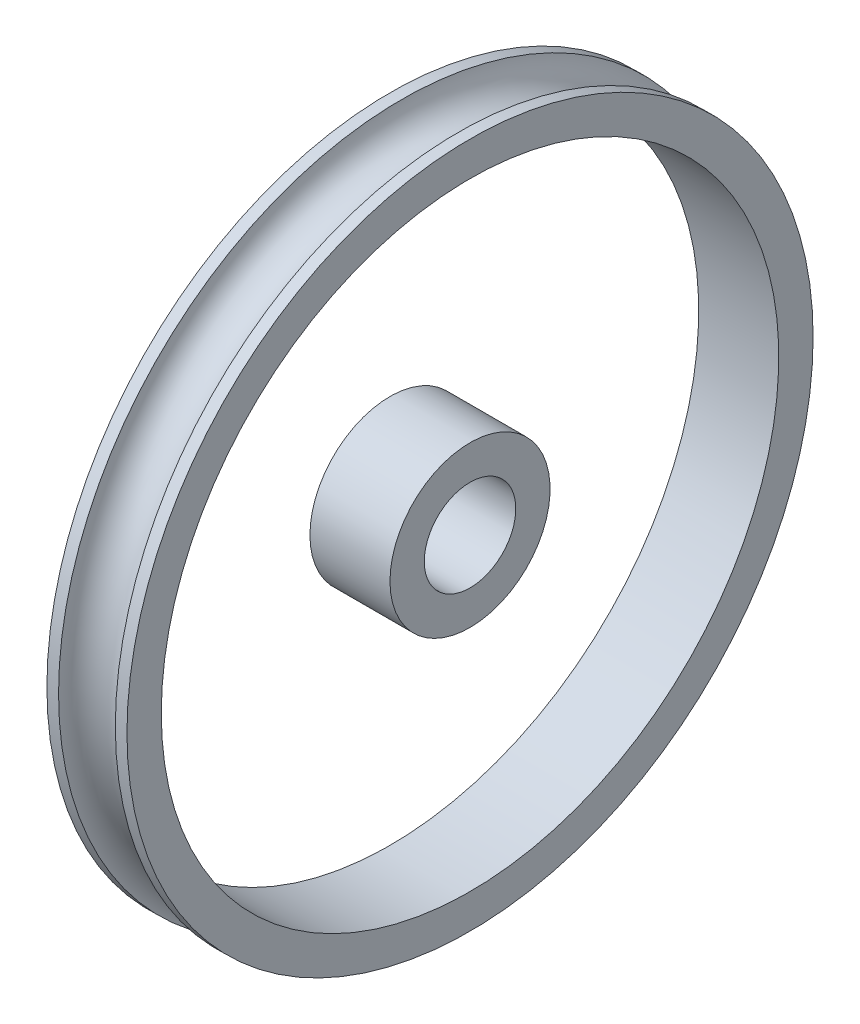
ISO-10303-21;
HEADER;
FILE_DESCRIPTION(('STEP AP214'),'2;1');
FILE_NAME('part.step','',(''),(''),'','','');
FILE_SCHEMA(('AUTOMOTIVE_DESIGN { 1 0 10303 214 1 1 1 1 }'));
ENDSEC;
DATA;
#1=APPLICATION_CONTEXT('core data for automotive mechanical design processes');
#2=APPLICATION_PROTOCOL_DEFINITION('international standard','automotive_design',2000,#1);
#3=PRODUCT_CONTEXT('',#1,'mechanical');
#4=PRODUCT('Part','Part','',(#3));
#5=PRODUCT_RELATED_PRODUCT_CATEGORY('part','',(#4));
#6=PRODUCT_DEFINITION_FORMATION('','',#4);
#7=PRODUCT_DEFINITION_CONTEXT('part definition',#1,'design');
#8=PRODUCT_DEFINITION('design','',#6,#7);
#9=PRODUCT_DEFINITION_SHAPE('','',#8);
#10=(LENGTH_UNIT() NAMED_UNIT(*) SI_UNIT(.MILLI.,.METRE.));
#11=(NAMED_UNIT(*) PLANE_ANGLE_UNIT() SI_UNIT($,.RADIAN.));
#12=(NAMED_UNIT(*) SI_UNIT($,.STERADIAN.) SOLID_ANGLE_UNIT());
#13=UNCERTAINTY_MEASURE_WITH_UNIT(LENGTH_MEASURE(1.E-05),#10,'distance_accuracy_value','');
#14=(GEOMETRIC_REPRESENTATION_CONTEXT(3) GLOBAL_UNCERTAINTY_ASSIGNED_CONTEXT((#13)) GLOBAL_UNIT_ASSIGNED_CONTEXT((#10,
#11,#12)) REPRESENTATION_CONTEXT('',''));
#15=CARTESIAN_POINT('',(0.,0.,0.));
#16=DIRECTION('',(0.,0.,1.));
#17=DIRECTION('',(1.,0.,0.));
#18=AXIS2_PLACEMENT_3D('',#15,#16,#17);
#19=CARTESIAN_POINT('',(0.,0.,-4.));
#20=DIRECTION('',(1.,0.,0.));
#21=DIRECTION('',(0.,0.,-1.));
#22=AXIS2_PLACEMENT_3D('',#19,#20,#21);
#23=PLANE('',#22);
#24=CARTESIAN_POINT('',(0.,0.,0.));
#25=DIRECTION('',(-1.,0.,0.));
#26=DIRECTION('',(0.,0.,1.));
#27=AXIS2_PLACEMENT_3D('',#24,#25,#26);
#28=CIRCLE('',#27,4.);
#29=CARTESIAN_POINT('',(0.,0.,4.));
#30=VERTEX_POINT('',#29);
#31=EDGE_CURVE('E63',#30,#30,#28,.T.);
#32=ORIENTED_EDGE('',*,*,#31,.F.);
#33=EDGE_LOOP('',(#32));
#34=FACE_BOUND('',#33,.T.);
#35=CARTESIAN_POINT('',(0.,0.,0.));
#36=DIRECTION('',(-1.,0.,0.));
#37=DIRECTION('',(0.,0.,1.));
#38=AXIS2_PLACEMENT_3D('',#35,#36,#37);
#39=CIRCLE('',#38,7.);
#40=CARTESIAN_POINT('',(0.,0.,7.));
#41=VERTEX_POINT('',#40);
#42=EDGE_CURVE('E11',#41,#41,#39,.T.);
#43=ORIENTED_EDGE('',*,*,#42,.T.);
#44=EDGE_LOOP('',(#43));
#45=FACE_BOUND('',#44,.T.);
#46=ADVANCED_FACE('F49',(#34,#45),#23,.F.);
#47=CARTESIAN_POINT('',(0.,0.,0.));
#48=DIRECTION('',(-1.,0.,0.));
#49=DIRECTION('',(0.,0.,1.));
#50=AXIS2_PLACEMENT_3D('',#47,#48,#49);
#51=CYLINDRICAL_SURFACE('',#50,7.);
#52=ORIENTED_EDGE('',*,*,#42,.F.);
#53=EDGE_LOOP('',(#52));
#54=FACE_BOUND('',#53,.T.);
#55=CARTESIAN_POINT('',(7.,0.,0.));
#56=DIRECTION('',(-1.,0.,0.));
#57=DIRECTION('',(0.,0.,1.));
#58=AXIS2_PLACEMENT_3D('',#55,#56,#57);
#59=CIRCLE('',#58,7.);
#60=CARTESIAN_POINT('',(7.,0.,7.));
#61=VERTEX_POINT('',#60);
#62=EDGE_CURVE('E55',#61,#61,#59,.T.);
#63=ORIENTED_EDGE('',*,*,#62,.T.);
#64=EDGE_LOOP('',(#63));
#65=FACE_BOUND('',#64,.T.);
#66=ADVANCED_FACE('F72',(#54,#65),#51,.T.);
#67=CARTESIAN_POINT('',(7.,0.,-4.));
#68=DIRECTION('',(-1.,0.,0.));
#69=DIRECTION('',(0.,0.,1.));
#70=AXIS2_PLACEMENT_3D('',#67,#68,#69);
#71=PLANE('',#70);
#72=ORIENTED_EDGE('',*,*,#62,.F.);
#73=EDGE_LOOP('',(#72));
#74=FACE_BOUND('',#73,.T.);
#75=CARTESIAN_POINT('',(7.,0.,0.));
#76=DIRECTION('',(-1.,0.,0.));
#77=DIRECTION('',(0.,0.,1.));
#78=AXIS2_PLACEMENT_3D('',#75,#76,#77);
#79=CIRCLE('',#78,4.);
#80=CARTESIAN_POINT('',(7.,0.,4.));
#81=VERTEX_POINT('',#80);
#82=EDGE_CURVE('E59',#81,#81,#79,.T.);
#83=ORIENTED_EDGE('',*,*,#82,.T.);
#84=EDGE_LOOP('',(#83));
#85=FACE_BOUND('',#84,.T.);
#86=ADVANCED_FACE('F76',(#74,#85),#71,.F.);
#87=CARTESIAN_POINT('',(0.,0.,0.));
#88=DIRECTION('',(-1.,0.,0.));
#89=DIRECTION('',(0.,0.,1.));
#90=AXIS2_PLACEMENT_3D('',#87,#88,#89);
#91=CYLINDRICAL_SURFACE('',#90,4.);
#92=ORIENTED_EDGE('',*,*,#82,.F.);
#93=EDGE_LOOP('',(#92));
#94=FACE_BOUND('',#93,.T.);
#95=ORIENTED_EDGE('',*,*,#31,.T.);
#96=EDGE_LOOP('',(#95));
#97=FACE_BOUND('',#96,.T.);
#98=ADVANCED_FACE('F69',(#94,#97),#91,.F.);
#99=CLOSED_SHELL('',(#46,#66,#86,#98));
#100=MANIFOLD_SOLID_BREP('B2',#99);
#101=CARTESIAN_POINT('',(7.,0.,-27.));
#102=DIRECTION('',(-1.,0.,0.));
#103=DIRECTION('',(0.,0.,1.));
#104=AXIS2_PLACEMENT_3D('',#101,#102,#103);
#105=PLANE('',#104);
#106=CARTESIAN_POINT('',(7.,0.,0.));
#107=DIRECTION('',(-1.,0.,0.));
#108=DIRECTION('',(0.,0.,1.));
#109=AXIS2_PLACEMENT_3D('',#106,#107,#108);
#110=CIRCLE('',#109,30.);
#111=CARTESIAN_POINT('',(7.,0.,30.));
#112=VERTEX_POINT('',#111);
#113=EDGE_CURVE('E48',#112,#112,#110,.T.);
#114=ORIENTED_EDGE('',*,*,#113,.F.);
#115=EDGE_LOOP('',(#114));
#116=FACE_BOUND('',#115,.T.);
#117=CARTESIAN_POINT('',(7.,0.,0.));
#118=DIRECTION('',(-1.,0.,0.));
#119=DIRECTION('',(0.,0.,1.));
#120=AXIS2_PLACEMENT_3D('',#117,#118,#119);
#121=CIRCLE('',#120,27.);
#122=CARTESIAN_POINT('',(7.,0.,27.));
#123=VERTEX_POINT('',#122);
#124=EDGE_CURVE('E146',#123,#123,#121,.T.);
#125=ORIENTED_EDGE('',*,*,#124,.T.);
#126=EDGE_LOOP('',(#125));
#127=FACE_BOUND('',#126,.T.);
#128=ADVANCED_FACE('F119',(#116,#127),#105,.F.);
#129=CARTESIAN_POINT('',(0.,0.,0.));
#130=DIRECTION('',(-1.,0.,0.));
#131=DIRECTION('',(0.,0.,1.));
#132=AXIS2_PLACEMENT_3D('',#129,#130,#131);
#133=CYLINDRICAL_SURFACE('',#132,30.);
#134=CARTESIAN_POINT('',(5.98193472919817,0.,0.));
#135=DIRECTION('',(-1.,0.,0.));
#136=DIRECTION('',(0.,0.,1.));
#137=AXIS2_PLACEMENT_3D('',#134,#135,#136);
#138=CIRCLE('',#137,30.);
#139=CARTESIAN_POINT('',(5.98193472919817,0.,30.));
#140=VERTEX_POINT('',#139);
#141=EDGE_CURVE('E126',#140,#140,#138,.T.);
#142=ORIENTED_EDGE('',*,*,#141,.F.);
#143=EDGE_LOOP('',(#142));
#144=FACE_BOUND('',#143,.T.);
#145=ORIENTED_EDGE('',*,*,#113,.T.);
#146=EDGE_LOOP('',(#145));
#147=FACE_BOUND('',#146,.T.);
#148=ADVANCED_FACE('F172',(#144,#147),#133,.T.);
#149=CARTESIAN_POINT('',(3.5,0.,0.));
#150=DIRECTION('',(-1.,0.,0.));
#151=DIRECTION('',(0.,0.,1.));
#152=AXIS2_PLACEMENT_3D('',#149,#150,#151);
#153=TOROIDAL_SURFACE('',#152,30.3,2.5);
#154=CARTESIAN_POINT('',(1.01806527080183,0.,0.));
#155=DIRECTION('',(-1.,0.,0.));
#156=DIRECTION('',(0.,0.,1.));
#157=AXIS2_PLACEMENT_3D('',#154,#155,#156);
#158=CIRCLE('',#157,30.);
#159=CARTESIAN_POINT('',(1.01806527080183,0.,30.));
#160=VERTEX_POINT('',#159);
#161=EDGE_CURVE('E131',#160,#160,#158,.T.);
#162=ORIENTED_EDGE('',*,*,#161,.F.);
#163=EDGE_LOOP('',(#162));
#164=FACE_BOUND('',#163,.T.);
#165=ORIENTED_EDGE('',*,*,#141,.T.);
#166=EDGE_LOOP('',(#165));
#167=FACE_BOUND('',#166,.T.);
#168=ADVANCED_FACE('F167',(#164,#167),#153,.F.);
#169=CARTESIAN_POINT('',(0.,0.,0.));
#170=DIRECTION('',(-1.,0.,0.));
#171=DIRECTION('',(0.,0.,1.));
#172=AXIS2_PLACEMENT_3D('',#169,#170,#171);
#173=CYLINDRICAL_SURFACE('',#172,30.);
#174=CARTESIAN_POINT('',(0.,0.,0.));
#175=DIRECTION('',(-1.,0.,0.));
#176=DIRECTION('',(0.,0.,1.));
#177=AXIS2_PLACEMENT_3D('',#174,#175,#176);
#178=CIRCLE('',#177,30.);
#179=CARTESIAN_POINT('',(0.,0.,30.));
#180=VERTEX_POINT('',#179);
#181=EDGE_CURVE('E136',#180,#180,#178,.T.);
#182=ORIENTED_EDGE('',*,*,#181,.F.);
#183=EDGE_LOOP('',(#182));
#184=FACE_BOUND('',#183,.T.);
#185=ORIENTED_EDGE('',*,*,#161,.T.);
#186=EDGE_LOOP('',(#185));
#187=FACE_BOUND('',#186,.T.);
#188=ADVANCED_FACE('F161',(#184,#187),#173,.T.);
#189=CARTESIAN_POINT('',(0.,0.,-27.));
#190=DIRECTION('',(1.,0.,0.));
#191=DIRECTION('',(0.,0.,-1.));
#192=AXIS2_PLACEMENT_3D('',#189,#190,#191);
#193=PLANE('',#192);
#194=CARTESIAN_POINT('',(0.,0.,0.));
#195=DIRECTION('',(-1.,0.,0.));
#196=DIRECTION('',(0.,0.,1.));
#197=AXIS2_PLACEMENT_3D('',#194,#195,#196);
#198=CIRCLE('',#197,27.);
#199=CARTESIAN_POINT('',(0.,0.,27.));
#200=VERTEX_POINT('',#199);
#201=EDGE_CURVE('E142',#200,#200,#198,.T.);
#202=ORIENTED_EDGE('',*,*,#201,.F.);
#203=EDGE_LOOP('',(#202));
#204=FACE_BOUND('',#203,.T.);
#205=ORIENTED_EDGE('',*,*,#181,.T.);
#206=EDGE_LOOP('',(#205));
#207=FACE_BOUND('',#206,.T.);
#208=ADVANCED_FACE('F155',(#204,#207),#193,.F.);
#209=CARTESIAN_POINT('',(0.,0.,0.));
#210=DIRECTION('',(-1.,0.,0.));
#211=DIRECTION('',(0.,0.,1.));
#212=AXIS2_PLACEMENT_3D('',#209,#210,#211);
#213=CYLINDRICAL_SURFACE('',#212,27.);
#214=ORIENTED_EDGE('',*,*,#124,.F.);
#215=EDGE_LOOP('',(#214));
#216=FACE_BOUND('',#215,.T.);
#217=ORIENTED_EDGE('',*,*,#201,.T.);
#218=EDGE_LOOP('',(#217));
#219=FACE_BOUND('',#218,.T.);
#220=ADVANCED_FACE('F152',(#216,#219),#213,.F.);
#221=CLOSED_SHELL('',(#128,#148,#168,#188,#208,#220));
#222=MANIFOLD_SOLID_BREP('B6',#221);
#223=ADVANCED_BREP_SHAPE_REPRESENTATION('',(#18,#100,#222),#14);
#224=SHAPE_DEFINITION_REPRESENTATION(#9,#223);
ENDSEC;
END-ISO-10303-21;
